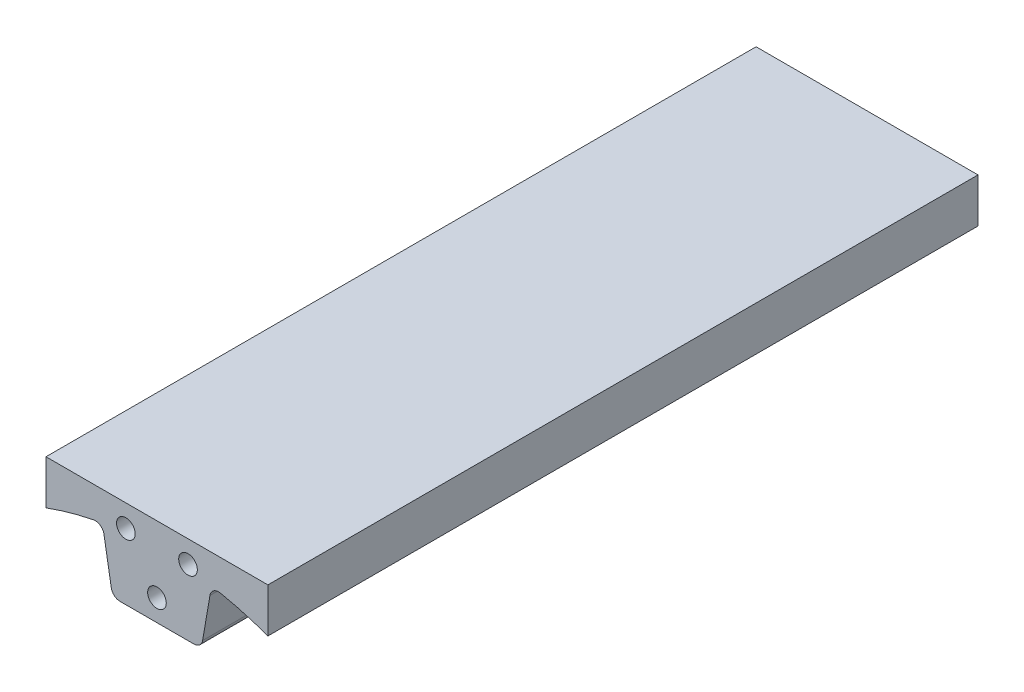
ISO-10303-21;
HEADER;
FILE_DESCRIPTION(('STEP AP214'),'2;1');
FILE_NAME('part.step','',(''),(''),'','','');
FILE_SCHEMA(('AUTOMOTIVE_DESIGN { 1 0 10303 214 1 1 1 1 }'));
ENDSEC;
DATA;
#1=APPLICATION_CONTEXT('core data for automotive mechanical design processes');
#2=APPLICATION_PROTOCOL_DEFINITION('international standard','automotive_design',2000,#1);
#3=PRODUCT_CONTEXT('',#1,'mechanical');
#4=PRODUCT('Part','Part','',(#3));
#5=PRODUCT_RELATED_PRODUCT_CATEGORY('part','',(#4));
#6=PRODUCT_DEFINITION_FORMATION('','',#4);
#7=PRODUCT_DEFINITION_CONTEXT('part definition',#1,'design');
#8=PRODUCT_DEFINITION('design','',#6,#7);
#9=PRODUCT_DEFINITION_SHAPE('','',#8);
#10=(LENGTH_UNIT() NAMED_UNIT(*) SI_UNIT(.MILLI.,.METRE.));
#11=(NAMED_UNIT(*) PLANE_ANGLE_UNIT() SI_UNIT($,.RADIAN.));
#12=(NAMED_UNIT(*) SI_UNIT($,.STERADIAN.) SOLID_ANGLE_UNIT());
#13=UNCERTAINTY_MEASURE_WITH_UNIT(LENGTH_MEASURE(1.E-05),#10,'distance_accuracy_value','');
#14=(GEOMETRIC_REPRESENTATION_CONTEXT(3) GLOBAL_UNCERTAINTY_ASSIGNED_CONTEXT((#13)) GLOBAL_UNIT_ASSIGNED_CONTEXT((#10,
#11,#12)) REPRESENTATION_CONTEXT('',''));
#15=CARTESIAN_POINT('',(0.,0.,0.));
#16=DIRECTION('',(0.,0.,1.));
#17=DIRECTION('',(1.,0.,0.));
#18=AXIS2_PLACEMENT_3D('',#15,#16,#17);
#19=CARTESIAN_POINT('',(12.7,73.8463201567954,203.2));
#20=DIRECTION('',(-0.985531811148546,0.169490557891188,0.));
#21=DIRECTION('',(-0.169490557891188,-0.985531811148546,0.));
#22=AXIS2_PLACEMENT_3D('',#19,#20,#21);
#23=PLANE('',#22);
#24=DIRECTION('',(0.169490557891188,0.985531811148546,0.));
#25=VECTOR('',#24,1.);
#26=CARTESIAN_POINT('',(12.7,73.8463201567954,203.2));
#27=LINE('',#26,#25);
#28=CARTESIAN_POINT('',(13.0627882002334,75.9558141397518,203.2));
#29=VERTEX_POINT('',#28);
#30=CARTESIAN_POINT('',(15.1692294033622,88.2040764608313,203.2));
#31=VERTEX_POINT('',#30);
#32=EDGE_CURVE('E136',#29,#31,#27,.T.);
#33=ORIENTED_EDGE('',*,*,#32,.F.);
#34=DIRECTION('',(0.,0.,-1.));
#35=VECTOR('',#34,1.);
#36=CARTESIAN_POINT('',(13.0627882002334,75.9558141397518,203.2));
#37=LINE('',#36,#35);
#38=CARTESIAN_POINT('',(13.0627882002334,75.9558141397518,0.));
#39=VERTEX_POINT('',#38);
#40=EDGE_CURVE('E240',#29,#39,#37,.T.);
#41=ORIENTED_EDGE('',*,*,#40,.T.);
#42=DIRECTION('',(0.169490557891188,0.985531811148546,0.));
#43=VECTOR('',#42,1.);
#44=CARTESIAN_POINT('',(12.7,73.8463201567954,0.));
#45=LINE('',#44,#43);
#46=CARTESIAN_POINT('',(15.1692294033622,88.2040764608313,0.));
#47=VERTEX_POINT('',#46);
#48=EDGE_CURVE('E174',#39,#47,#45,.T.);
#49=ORIENTED_EDGE('',*,*,#48,.T.);
#50=DIRECTION('',(0.,0.,1.));
#51=VECTOR('',#50,1.);
#52=CARTESIAN_POINT('',(15.1692294033622,88.2040764608313,203.2));
#53=LINE('',#52,#51);
#54=EDGE_CURVE('E60',#47,#31,#53,.T.);
#55=ORIENTED_EDGE('',*,*,#54,.T.);
#56=EDGE_LOOP('',(#33,#41,#49,#55));
#57=FACE_BOUND('',#56,.T.);
#58=ADVANCED_FACE('F38',(#57),#23,.F.);
#59=CARTESIAN_POINT('',(0.,0.,203.2));
#60=DIRECTION('',(0.,0.,-1.));
#61=DIRECTION('',(-1.,0.,0.));
#62=AXIS2_PLACEMENT_3D('',#59,#60,#61);
#63=CYLINDRICAL_SURFACE('',#62,92.075);
#64=CARTESIAN_POINT('',(0.,0.,203.2));
#65=DIRECTION('',(0.,0.,-1.));
#66=DIRECTION('',(1.,0.,0.));
#67=AXIS2_PLACEMENT_3D('',#64,#65,#66);
#68=CIRCLE('',#67,92.075);
#69=CARTESIAN_POINT('',(18.1738271598122,90.2636008109873,203.2));
#70=VERTEX_POINT('',#69);
#71=CARTESIAN_POINT('',(31.75,86.4276756889829,203.2));
#72=VERTEX_POINT('',#71);
#73=EDGE_CURVE('E125',#70,#72,#68,.T.);
#74=ORIENTED_EDGE('',*,*,#73,.F.);
#75=DIRECTION('',(0.,0.,-1.));
#76=VECTOR('',#75,1.);
#77=CARTESIAN_POINT('',(18.1738271598122,90.2636008109873,203.2));
#78=LINE('',#77,#76);
#79=CARTESIAN_POINT('',(18.1738271598122,90.2636008109873,0.));
#80=VERTEX_POINT('',#79);
#81=EDGE_CURVE('E244',#70,#80,#78,.T.);
#82=ORIENTED_EDGE('',*,*,#81,.T.);
#83=CARTESIAN_POINT('',(0.,0.,0.));
#84=DIRECTION('',(0.,0.,-1.));
#85=DIRECTION('',(1.,0.,0.));
#86=AXIS2_PLACEMENT_3D('',#83,#84,#85);
#87=CIRCLE('',#86,92.075);
#88=CARTESIAN_POINT('',(31.75,86.4276756889829,0.));
#89=VERTEX_POINT('',#88);
#90=EDGE_CURVE('E142',#80,#89,#87,.T.);
#91=ORIENTED_EDGE('',*,*,#90,.T.);
#92=DIRECTION('',(0.,0.,-1.));
#93=VECTOR('',#92,1.);
#94=CARTESIAN_POINT('',(31.75,86.4276756889829,203.2));
#95=LINE('',#94,#93);
#96=EDGE_CURVE('E139',#72,#89,#95,.T.);
#97=ORIENTED_EDGE('',*,*,#96,.F.);
#98=EDGE_LOOP('',(#74,#82,#91,#97));
#99=FACE_BOUND('',#98,.T.);
#100=ADVANCED_FACE('F140',(#99),#63,.F.);
#101=CARTESIAN_POINT('',(31.75,99.1022756889829,203.2));
#102=DIRECTION('',(-1.,0.,0.));
#103=DIRECTION('',(0.,-1.,0.));
#104=AXIS2_PLACEMENT_3D('',#101,#102,#103);
#105=PLANE('',#104);
#106=DIRECTION('',(0.,1.,0.));
#107=VECTOR('',#106,1.);
#108=CARTESIAN_POINT('',(31.75,99.1022756889829,0.));
#109=LINE('',#108,#107);
#110=CARTESIAN_POINT('',(31.75,99.1022756889829,0.));
#111=VERTEX_POINT('',#110);
#112=EDGE_CURVE('E180',#89,#111,#109,.T.);
#113=ORIENTED_EDGE('',*,*,#112,.T.);
#114=DIRECTION('',(0.,0.,-1.));
#115=VECTOR('',#114,1.);
#116=CARTESIAN_POINT('',(31.75,99.1022756889829,203.2));
#117=LINE('',#116,#115);
#118=CARTESIAN_POINT('',(31.75,99.1022756889829,203.2));
#119=VERTEX_POINT('',#118);
#120=EDGE_CURVE('E147',#119,#111,#117,.T.);
#121=ORIENTED_EDGE('',*,*,#120,.F.);
#122=DIRECTION('',(0.,1.,0.));
#123=VECTOR('',#122,1.);
#124=CARTESIAN_POINT('',(31.75,99.1022756889829,203.2));
#125=LINE('',#124,#123);
#126=EDGE_CURVE('E130',#72,#119,#125,.T.);
#127=ORIENTED_EDGE('',*,*,#126,.F.);
#128=ORIENTED_EDGE('',*,*,#96,.T.);
#129=EDGE_LOOP('',(#113,#121,#127,#128));
#130=FACE_BOUND('',#129,.T.);
#131=ADVANCED_FACE('F149',(#130),#105,.F.);
#132=CARTESIAN_POINT('',(-31.75,99.1022756889829,203.2));
#133=DIRECTION('',(0.,-1.,0.));
#134=DIRECTION('',(0.,0.,-1.));
#135=AXIS2_PLACEMENT_3D('',#132,#133,#134);
#136=PLANE('',#135);
#137=DIRECTION('',(-1.,0.,0.));
#138=VECTOR('',#137,1.);
#139=CARTESIAN_POINT('',(-31.75,99.1022756889829,0.));
#140=LINE('',#139,#138);
#141=CARTESIAN_POINT('',(-31.75,99.1022756889829,0.));
#142=VERTEX_POINT('',#141);
#143=EDGE_CURVE('E183',#111,#142,#140,.T.);
#144=ORIENTED_EDGE('',*,*,#143,.T.);
#145=DIRECTION('',(0.,0.,-1.));
#146=VECTOR('',#145,1.);
#147=CARTESIAN_POINT('',(-31.75,99.1022756889829,203.2));
#148=LINE('',#147,#146);
#149=CARTESIAN_POINT('',(-31.75,99.1022756889829,203.2));
#150=VERTEX_POINT('',#149);
#151=EDGE_CURVE('E204',#150,#142,#148,.T.);
#152=ORIENTED_EDGE('',*,*,#151,.F.);
#153=DIRECTION('',(-1.,0.,0.));
#154=VECTOR('',#153,1.);
#155=CARTESIAN_POINT('',(-31.75,99.1022756889829,203.2));
#156=LINE('',#155,#154);
#157=EDGE_CURVE('E153',#119,#150,#156,.T.);
#158=ORIENTED_EDGE('',*,*,#157,.F.);
#159=ORIENTED_EDGE('',*,*,#120,.T.);
#160=EDGE_LOOP('',(#144,#152,#158,#159));
#161=FACE_BOUND('',#160,.T.);
#162=ADVANCED_FACE('F369',(#161),#136,.F.);
#163=CARTESIAN_POINT('',(-31.75,99.1022756889829,203.2));
#164=DIRECTION('',(1.,0.,0.));
#165=DIRECTION('',(0.,1.,0.));
#166=AXIS2_PLACEMENT_3D('',#163,#164,#165);
#167=PLANE('',#166);
#168=DIRECTION('',(0.,-1.,0.));
#169=VECTOR('',#168,1.);
#170=CARTESIAN_POINT('',(-31.75,99.1022756889829,0.));
#171=LINE('',#170,#169);
#172=CARTESIAN_POINT('',(-31.75,86.4276756889829,0.));
#173=VERTEX_POINT('',#172);
#174=EDGE_CURVE('E186',#142,#173,#171,.T.);
#175=ORIENTED_EDGE('',*,*,#174,.T.);
#176=DIRECTION('',(0.,0.,-1.));
#177=VECTOR('',#176,1.);
#178=CARTESIAN_POINT('',(-31.75,86.4276756889829,203.2));
#179=LINE('',#178,#177);
#180=CARTESIAN_POINT('',(-31.75,86.4276756889829,203.2));
#181=VERTEX_POINT('',#180);
#182=EDGE_CURVE('E173',#181,#173,#179,.T.);
#183=ORIENTED_EDGE('',*,*,#182,.F.);
#184=DIRECTION('',(0.,-1.,0.));
#185=VECTOR('',#184,1.);
#186=CARTESIAN_POINT('',(-31.75,99.1022756889829,203.2));
#187=LINE('',#186,#185);
#188=EDGE_CURVE('E156',#150,#181,#187,.T.);
#189=ORIENTED_EDGE('',*,*,#188,.F.);
#190=ORIENTED_EDGE('',*,*,#151,.T.);
#191=EDGE_LOOP('',(#175,#183,#189,#190));
#192=FACE_BOUND('',#191,.T.);
#193=ADVANCED_FACE('F365',(#192),#167,.F.);
#194=CARTESIAN_POINT('',(0.,0.,203.2));
#195=DIRECTION('',(0.,0.,-1.));
#196=DIRECTION('',(-1.,0.,0.));
#197=AXIS2_PLACEMENT_3D('',#194,#195,#196);
#198=CYLINDRICAL_SURFACE('',#197,92.075);
#199=CARTESIAN_POINT('',(0.,0.,0.));
#200=DIRECTION('',(0.,0.,-1.));
#201=DIRECTION('',(-1.,0.,0.));
#202=AXIS2_PLACEMENT_3D('',#199,#200,#201);
#203=CIRCLE('',#202,92.075);
#204=CARTESIAN_POINT('',(-18.1738271598122,90.2636008109873,0.));
#205=VERTEX_POINT('',#204);
#206=EDGE_CURVE('E189',#173,#205,#203,.T.);
#207=ORIENTED_EDGE('',*,*,#206,.T.);
#208=DIRECTION('',(0.,0.,-1.));
#209=VECTOR('',#208,1.);
#210=CARTESIAN_POINT('',(-18.1738271598122,90.2636008109873,203.2));
#211=LINE('',#210,#209);
#212=CARTESIAN_POINT('',(-18.1738271598122,90.2636008109873,203.2));
#213=VERTEX_POINT('',#212);
#214=EDGE_CURVE('E216',#205,#213,#211,.F.);
#215=ORIENTED_EDGE('',*,*,#214,.T.);
#216=CARTESIAN_POINT('',(0.,0.,203.2));
#217=DIRECTION('',(0.,0.,-1.));
#218=DIRECTION('',(-1.,0.,0.));
#219=AXIS2_PLACEMENT_3D('',#216,#217,#218);
#220=CIRCLE('',#219,92.075);
#221=EDGE_CURVE('E162',#181,#213,#220,.T.);
#222=ORIENTED_EDGE('',*,*,#221,.F.);
#223=ORIENTED_EDGE('',*,*,#182,.T.);
#224=EDGE_LOOP('',(#207,#215,#222,#223));
#225=FACE_BOUND('',#224,.T.);
#226=ADVANCED_FACE('F361',(#225),#198,.F.);
#227=CARTESIAN_POINT('',(-12.7,73.8463201567954,203.2));
#228=DIRECTION('',(0.985531811148546,0.169490557891188,0.));
#229=DIRECTION('',(-0.169490557891188,0.985531811148546,0.));
#230=AXIS2_PLACEMENT_3D('',#227,#228,#229);
#231=PLANE('',#230);
#232=DIRECTION('',(0.169490557891188,-0.985531811148546,0.));
#233=VECTOR('',#232,1.);
#234=CARTESIAN_POINT('',(-12.7,73.8463201567954,203.2));
#235=LINE('',#234,#233);
#236=CARTESIAN_POINT('',(-15.1692294033622,88.2040764608313,203.2));
#237=VERTEX_POINT('',#236);
#238=CARTESIAN_POINT('',(-13.0627882002334,75.9558141397518,203.2));
#239=VERTEX_POINT('',#238);
#240=EDGE_CURVE('E166',#237,#239,#235,.T.);
#241=ORIENTED_EDGE('',*,*,#240,.F.);
#242=DIRECTION('',(0.,0.,1.));
#243=VECTOR('',#242,1.);
#244=CARTESIAN_POINT('',(-15.1692294033622,88.2040764608313,0.));
#245=LINE('',#244,#243);
#246=CARTESIAN_POINT('',(-15.1692294033622,88.2040764608313,0.));
#247=VERTEX_POINT('',#246);
#248=EDGE_CURVE('E212',#237,#247,#245,.F.);
#249=ORIENTED_EDGE('',*,*,#248,.T.);
#250=DIRECTION('',(0.169490557891188,-0.985531811148546,0.));
#251=VECTOR('',#250,1.);
#252=CARTESIAN_POINT('',(-12.7,73.8463201567954,0.));
#253=LINE('',#252,#251);
#254=CARTESIAN_POINT('',(-13.0627882002334,75.9558141397518,0.));
#255=VERTEX_POINT('',#254);
#256=EDGE_CURVE('E193',#247,#255,#253,.T.);
#257=ORIENTED_EDGE('',*,*,#256,.T.);
#258=DIRECTION('',(0.,0.,-1.));
#259=VECTOR('',#258,1.);
#260=CARTESIAN_POINT('',(-13.0627882002334,75.9558141397518,203.2));
#261=LINE('',#260,#259);
#262=EDGE_CURVE('E146',#255,#239,#261,.F.);
#263=ORIENTED_EDGE('',*,*,#262,.T.);
#264=EDGE_LOOP('',(#241,#249,#257,#263));
#265=FACE_BOUND('',#264,.T.);
#266=ADVANCED_FACE('F358',(#265),#231,.F.);
#267=CARTESIAN_POINT('',(-12.7,73.8463201567954,203.2));
#268=DIRECTION('',(0.,1.,0.));
#269=DIRECTION('',(0.,0.,1.));
#270=AXIS2_PLACEMENT_3D('',#267,#268,#269);
#271=PLANE('',#270);
#272=DIRECTION('',(1.,0.,0.));
#273=VECTOR('',#272,1.);
#274=CARTESIAN_POINT('',(-12.7,73.8463201567954,203.2));
#275=LINE('',#274,#273);
#276=CARTESIAN_POINT('',(-10.5595373999161,73.8463201567954,203.2));
#277=VERTEX_POINT('',#276);
#278=CARTESIAN_POINT('',(10.5595373999161,73.8463201567954,203.2));
#279=VERTEX_POINT('',#278);
#280=EDGE_CURVE('E169',#277,#279,#275,.T.);
#281=ORIENTED_EDGE('',*,*,#280,.F.);
#282=DIRECTION('',(0.,0.,-1.));
#283=VECTOR('',#282,1.);
#284=CARTESIAN_POINT('',(-10.5595373999161,73.8463201567954,203.2));
#285=LINE('',#284,#283);
#286=CARTESIAN_POINT('',(-10.5595373999161,73.8463201567954,0.));
#287=VERTEX_POINT('',#286);
#288=EDGE_CURVE('E222',#277,#287,#285,.T.);
#289=ORIENTED_EDGE('',*,*,#288,.T.);
#290=DIRECTION('',(1.,0.,0.));
#291=VECTOR('',#290,1.);
#292=CARTESIAN_POINT('',(-12.7,73.8463201567954,0.));
#293=LINE('',#292,#291);
#294=CARTESIAN_POINT('',(10.5595373999161,73.8463201567954,0.));
#295=VERTEX_POINT('',#294);
#296=EDGE_CURVE('E197',#287,#295,#293,.T.);
#297=ORIENTED_EDGE('',*,*,#296,.T.);
#298=DIRECTION('',(0.,0.,-1.));
#299=VECTOR('',#298,1.);
#300=CARTESIAN_POINT('',(10.5595373999161,73.8463201567954,203.2));
#301=LINE('',#300,#299);
#302=EDGE_CURVE('E219',#295,#279,#301,.F.);
#303=ORIENTED_EDGE('',*,*,#302,.T.);
#304=EDGE_LOOP('',(#281,#289,#297,#303));
#305=FACE_BOUND('',#304,.T.);
#306=ADVANCED_FACE('F294',(#305),#271,.F.);
#307=CARTESIAN_POINT('',(0.,0.,203.2));
#308=DIRECTION('',(0.,0.,1.));
#309=DIRECTION('',(1.,0.,0.));
#310=AXIS2_PLACEMENT_3D('',#307,#308,#309);
#311=PLANE('',#310);
#312=CARTESIAN_POINT('',(0.,80.0522756889829,203.2));
#313=DIRECTION('',(0.,0.,1.));
#314=DIRECTION('',(1.,0.,0.));
#315=AXIS2_PLACEMENT_3D('',#312,#313,#314);
#316=CIRCLE('',#315,2.667);
#317=CARTESIAN_POINT('',(2.667,80.0522756889829,203.2));
#318=VERTEX_POINT('',#317);
#319=EDGE_CURVE('E314',#318,#318,#316,.T.);
#320=ORIENTED_EDGE('',*,*,#319,.F.);
#321=EDGE_LOOP('',(#320));
#322=FACE_BOUND('',#321,.T.);
#323=CARTESIAN_POINT('',(8.89,92.7522756889829,203.2));
#324=DIRECTION('',(0.,0.,1.));
#325=DIRECTION('',(1.,0.,0.));
#326=AXIS2_PLACEMENT_3D('',#323,#324,#325);
#327=CIRCLE('',#326,2.667);
#328=CARTESIAN_POINT('',(11.557,92.7522756889829,203.2));
#329=VERTEX_POINT('',#328);
#330=EDGE_CURVE('E310',#329,#329,#327,.T.);
#331=ORIENTED_EDGE('',*,*,#330,.F.);
#332=EDGE_LOOP('',(#331));
#333=FACE_BOUND('',#332,.T.);
#334=CARTESIAN_POINT('',(-8.89,92.7522756889829,203.2));
#335=DIRECTION('',(0.,0.,1.));
#336=DIRECTION('',(1.,0.,0.));
#337=AXIS2_PLACEMENT_3D('',#334,#335,#336);
#338=CIRCLE('',#337,2.667);
#339=CARTESIAN_POINT('',(-6.223,92.7522756889829,203.2));
#340=VERTEX_POINT('',#339);
#341=EDGE_CURVE('E302',#340,#340,#338,.T.);
#342=ORIENTED_EDGE('',*,*,#341,.F.);
#343=EDGE_LOOP('',(#342));
#344=FACE_BOUND('',#343,.T.);
#345=ORIENTED_EDGE('',*,*,#240,.T.);
#346=CARTESIAN_POINT('',(-10.5595373999161,76.3863201567954,203.2));
#347=DIRECTION('',(0.,0.,1.));
#348=DIRECTION('',(1.,0.,0.));
#349=AXIS2_PLACEMENT_3D('',#346,#347,#348);
#350=CIRCLE('',#349,2.54);
#351=EDGE_CURVE('E235',#239,#277,#350,.T.);
#352=ORIENTED_EDGE('',*,*,#351,.T.);
#353=ORIENTED_EDGE('',*,*,#280,.T.);
#354=CARTESIAN_POINT('',(10.5595373999161,76.3863201567954,203.2));
#355=DIRECTION('',(0.,0.,1.));
#356=DIRECTION('',(1.,0.,0.));
#357=AXIS2_PLACEMENT_3D('',#354,#355,#356);
#358=CIRCLE('',#357,2.54);
#359=EDGE_CURVE('E232',#279,#29,#358,.T.);
#360=ORIENTED_EDGE('',*,*,#359,.T.);
#361=ORIENTED_EDGE('',*,*,#32,.T.);
#362=CARTESIAN_POINT('',(17.6724802036795,87.7735704437876,203.2));
#363=DIRECTION('',(0.,0.,1.));
#364=DIRECTION('',(1.,0.,0.));
#365=AXIS2_PLACEMENT_3D('',#362,#363,#364);
#366=CIRCLE('',#365,2.54);
#367=EDGE_CURVE('E11',#31,#70,#366,.F.);
#368=ORIENTED_EDGE('',*,*,#367,.T.);
#369=ORIENTED_EDGE('',*,*,#73,.T.);
#370=ORIENTED_EDGE('',*,*,#126,.T.);
#371=ORIENTED_EDGE('',*,*,#157,.T.);
#372=ORIENTED_EDGE('',*,*,#188,.T.);
#373=ORIENTED_EDGE('',*,*,#221,.T.);
#374=CARTESIAN_POINT('',(-17.6724802036795,87.7735704437876,203.2));
#375=DIRECTION('',(0.,0.,1.));
#376=DIRECTION('',(1.,0.,0.));
#377=AXIS2_PLACEMENT_3D('',#374,#375,#376);
#378=CIRCLE('',#377,2.54);
#379=EDGE_CURVE('E250',#213,#237,#378,.F.);
#380=ORIENTED_EDGE('',*,*,#379,.T.);
#381=EDGE_LOOP('',(#345,#352,#353,#360,#361,#368,#369,#370,#371,#372,#373,#380));
#382=FACE_BOUND('',#381,.T.);
#383=ADVANCED_FACE('F128',(#322,#333,#344,#382),#311,.T.);
#384=CARTESIAN_POINT('',(0.,0.,0.));
#385=DIRECTION('',(0.,0.,1.));
#386=DIRECTION('',(1.,0.,0.));
#387=AXIS2_PLACEMENT_3D('',#384,#385,#386);
#388=PLANE('',#387);
#389=ORIENTED_EDGE('',*,*,#296,.F.);
#390=CARTESIAN_POINT('',(-10.5595373999161,76.3863201567954,0.));
#391=DIRECTION('',(0.,0.,1.));
#392=DIRECTION('',(1.,0.,0.));
#393=AXIS2_PLACEMENT_3D('',#390,#391,#392);
#394=CIRCLE('',#393,2.54);
#395=EDGE_CURVE('E229',#287,#255,#394,.F.);
#396=ORIENTED_EDGE('',*,*,#395,.T.);
#397=ORIENTED_EDGE('',*,*,#256,.F.);
#398=CARTESIAN_POINT('',(-17.6724802036795,87.7735704437876,0.));
#399=DIRECTION('',(0.,0.,1.));
#400=DIRECTION('',(1.,0.,0.));
#401=AXIS2_PLACEMENT_3D('',#398,#399,#400);
#402=CIRCLE('',#401,2.54);
#403=EDGE_CURVE('E247',#247,#205,#402,.T.);
#404=ORIENTED_EDGE('',*,*,#403,.T.);
#405=ORIENTED_EDGE('',*,*,#206,.F.);
#406=ORIENTED_EDGE('',*,*,#174,.F.);
#407=ORIENTED_EDGE('',*,*,#143,.F.);
#408=ORIENTED_EDGE('',*,*,#112,.F.);
#409=ORIENTED_EDGE('',*,*,#90,.F.);
#410=CARTESIAN_POINT('',(17.6724802036795,87.7735704437876,0.));
#411=DIRECTION('',(0.,0.,1.));
#412=DIRECTION('',(1.,0.,0.));
#413=AXIS2_PLACEMENT_3D('',#410,#411,#412);
#414=CIRCLE('',#413,2.54);
#415=EDGE_CURVE('E47',#80,#47,#414,.T.);
#416=ORIENTED_EDGE('',*,*,#415,.T.);
#417=ORIENTED_EDGE('',*,*,#48,.F.);
#418=CARTESIAN_POINT('',(10.5595373999161,76.3863201567954,0.));
#419=DIRECTION('',(0.,0.,1.));
#420=DIRECTION('',(1.,0.,0.));
#421=AXIS2_PLACEMENT_3D('',#418,#419,#420);
#422=CIRCLE('',#421,2.54);
#423=EDGE_CURVE('E226',#39,#295,#422,.F.);
#424=ORIENTED_EDGE('',*,*,#423,.T.);
#425=EDGE_LOOP('',(#389,#396,#397,#404,#405,#406,#407,#408,#409,#416,#417,#424));
#426=FACE_BOUND('',#425,.T.);
#427=ADVANCED_FACE('F256',(#426),#388,.F.);
#428=CARTESIAN_POINT('',(-17.6724802036795,87.7735704437876,203.2));
#429=DIRECTION('',(0.,0.,-1.));
#430=DIRECTION('',(-1.,0.,0.));
#431=AXIS2_PLACEMENT_3D('',#428,#429,#430);
#432=CYLINDRICAL_SURFACE('',#431,2.54);
#433=ORIENTED_EDGE('',*,*,#379,.F.);
#434=ORIENTED_EDGE('',*,*,#214,.F.);
#435=ORIENTED_EDGE('',*,*,#403,.F.);
#436=ORIENTED_EDGE('',*,*,#248,.F.);
#437=EDGE_LOOP('',(#433,#434,#435,#436));
#438=FACE_BOUND('',#437,.T.);
#439=ADVANCED_FACE('F279',(#438),#432,.F.);
#440=CARTESIAN_POINT('',(-10.5595373999161,76.3863201567954,203.2));
#441=DIRECTION('',(0.,0.,-1.));
#442=DIRECTION('',(-1.,0.,0.));
#443=AXIS2_PLACEMENT_3D('',#440,#441,#442);
#444=CYLINDRICAL_SURFACE('',#443,2.54);
#445=ORIENTED_EDGE('',*,*,#351,.F.);
#446=ORIENTED_EDGE('',*,*,#262,.F.);
#447=ORIENTED_EDGE('',*,*,#395,.F.);
#448=ORIENTED_EDGE('',*,*,#288,.F.);
#449=EDGE_LOOP('',(#445,#446,#447,#448));
#450=FACE_BOUND('',#449,.T.);
#451=ADVANCED_FACE('F269',(#450),#444,.T.);
#452=CARTESIAN_POINT('',(10.5595373999161,76.3863201567954,203.2));
#453=DIRECTION('',(0.,0.,-1.));
#454=DIRECTION('',(-1.,0.,0.));
#455=AXIS2_PLACEMENT_3D('',#452,#453,#454);
#456=CYLINDRICAL_SURFACE('',#455,2.54);
#457=ORIENTED_EDGE('',*,*,#359,.F.);
#458=ORIENTED_EDGE('',*,*,#302,.F.);
#459=ORIENTED_EDGE('',*,*,#423,.F.);
#460=ORIENTED_EDGE('',*,*,#40,.F.);
#461=EDGE_LOOP('',(#457,#458,#459,#460));
#462=FACE_BOUND('',#461,.T.);
#463=ADVANCED_FACE('F261',(#462),#456,.T.);
#464=CARTESIAN_POINT('',(17.6724802036795,87.7735704437876,203.2));
#465=DIRECTION('',(0.,0.,-1.));
#466=DIRECTION('',(-1.,0.,0.));
#467=AXIS2_PLACEMENT_3D('',#464,#465,#466);
#468=CYLINDRICAL_SURFACE('',#467,2.54);
#469=ORIENTED_EDGE('',*,*,#367,.F.);
#470=ORIENTED_EDGE('',*,*,#54,.F.);
#471=ORIENTED_EDGE('',*,*,#415,.F.);
#472=ORIENTED_EDGE('',*,*,#81,.F.);
#473=EDGE_LOOP('',(#469,#470,#471,#472));
#474=FACE_BOUND('',#473,.T.);
#475=ADVANCED_FACE('F40',(#474),#468,.F.);
#476=CARTESIAN_POINT('',(-8.89,92.7522756889829,191.77));
#477=DIRECTION('',(0.,0.,1.));
#478=DIRECTION('',(1.,0.,0.));
#479=AXIS2_PLACEMENT_3D('',#476,#477,#478);
#480=CYLINDRICAL_SURFACE('',#479,2.667);
#481=CARTESIAN_POINT('',(-8.89,92.7522756889829,191.77));
#482=DIRECTION('',(0.,0.,1.));
#483=DIRECTION('',(1.,0.,0.));
#484=AXIS2_PLACEMENT_3D('',#481,#482,#483);
#485=CIRCLE('',#484,2.667);
#486=CARTESIAN_POINT('',(-6.223,92.7522756889829,191.77));
#487=VERTEX_POINT('',#486);
#488=EDGE_CURVE('E298',#487,#487,#485,.T.);
#489=ORIENTED_EDGE('',*,*,#488,.F.);
#490=EDGE_LOOP('',(#489));
#491=FACE_BOUND('',#490,.T.);
#492=ORIENTED_EDGE('',*,*,#341,.T.);
#493=EDGE_LOOP('',(#492));
#494=FACE_BOUND('',#493,.T.);
#495=ADVANCED_FACE('F260',(#491,#494),#480,.F.);
#496=CARTESIAN_POINT('',(-8.89,92.7522756889829,191.77));
#497=DIRECTION('',(0.,0.,1.));
#498=DIRECTION('',(1.,0.,0.));
#499=AXIS2_PLACEMENT_3D('',#496,#497,#498);
#500=PLANE('',#499);
#501=ORIENTED_EDGE('',*,*,#488,.T.);
#502=EDGE_LOOP('',(#501));
#503=FACE_BOUND('',#502,.T.);
#504=ADVANCED_FACE('F266',(#503),#500,.T.);
#505=CARTESIAN_POINT('',(8.89,92.7522756889829,191.77));
#506=DIRECTION('',(0.,0.,1.));
#507=DIRECTION('',(1.,0.,0.));
#508=AXIS2_PLACEMENT_3D('',#505,#506,#507);
#509=CYLINDRICAL_SURFACE('',#508,2.667);
#510=CARTESIAN_POINT('',(8.89,92.7522756889829,191.77));
#511=DIRECTION('',(0.,0.,1.));
#512=DIRECTION('',(1.,0.,0.));
#513=AXIS2_PLACEMENT_3D('',#510,#511,#512);
#514=CIRCLE('',#513,2.667);
#515=CARTESIAN_POINT('',(11.557,92.7522756889829,191.77));
#516=VERTEX_POINT('',#515);
#517=EDGE_CURVE('E306',#516,#516,#514,.T.);
#518=ORIENTED_EDGE('',*,*,#517,.F.);
#519=EDGE_LOOP('',(#518));
#520=FACE_BOUND('',#519,.T.);
#521=ORIENTED_EDGE('',*,*,#330,.T.);
#522=EDGE_LOOP('',(#521));
#523=FACE_BOUND('',#522,.T.);
#524=ADVANCED_FACE('F339',(#520,#523),#509,.F.);
#525=CARTESIAN_POINT('',(8.89,92.7522756889829,191.77));
#526=DIRECTION('',(0.,0.,1.));
#527=DIRECTION('',(1.,0.,0.));
#528=AXIS2_PLACEMENT_3D('',#525,#526,#527);
#529=PLANE('',#528);
#530=ORIENTED_EDGE('',*,*,#517,.T.);
#531=EDGE_LOOP('',(#530));
#532=FACE_BOUND('',#531,.T.);
#533=ADVANCED_FACE('F327',(#532),#529,.T.);
#534=CARTESIAN_POINT('',(0.,80.0522756889829,191.77));
#535=DIRECTION('',(0.,0.,1.));
#536=DIRECTION('',(1.,0.,0.));
#537=AXIS2_PLACEMENT_3D('',#534,#535,#536);
#538=CYLINDRICAL_SURFACE('',#537,2.667);
#539=CARTESIAN_POINT('',(0.,80.0522756889829,191.77));
#540=DIRECTION('',(0.,0.,1.));
#541=DIRECTION('',(1.,0.,0.));
#542=AXIS2_PLACEMENT_3D('',#539,#540,#541);
#543=CIRCLE('',#542,2.667);
#544=CARTESIAN_POINT('',(2.667,80.0522756889829,191.77));
#545=VERTEX_POINT('',#544);
#546=EDGE_CURVE('E177',#545,#545,#543,.T.);
#547=ORIENTED_EDGE('',*,*,#546,.F.);
#548=EDGE_LOOP('',(#547));
#549=FACE_BOUND('',#548,.T.);
#550=ORIENTED_EDGE('',*,*,#319,.T.);
#551=EDGE_LOOP('',(#550));
#552=FACE_BOUND('',#551,.T.);
#553=ADVANCED_FACE('F324',(#549,#552),#538,.F.);
#554=CARTESIAN_POINT('',(0.,80.0522756889829,191.77));
#555=DIRECTION('',(0.,0.,1.));
#556=DIRECTION('',(1.,0.,0.));
#557=AXIS2_PLACEMENT_3D('',#554,#555,#556);
#558=PLANE('',#557);
#559=ORIENTED_EDGE('',*,*,#546,.T.);
#560=EDGE_LOOP('',(#559));
#561=FACE_BOUND('',#560,.T.);
#562=ADVANCED_FACE('F322',(#561),#558,.T.);
#563=CLOSED_SHELL('',(#58,#100,#131,#162,#193,#226,#266,#306,#383,#427,#439,#451,#463,#475,#495,
#504,#524,#533,#553,#562));
#564=MANIFOLD_SOLID_BREP('B2',#563);
#565=ADVANCED_BREP_SHAPE_REPRESENTATION('',(#18,#564),#14);
#566=SHAPE_DEFINITION_REPRESENTATION(#9,#565);
ENDSEC;
END-ISO-10303-21;
